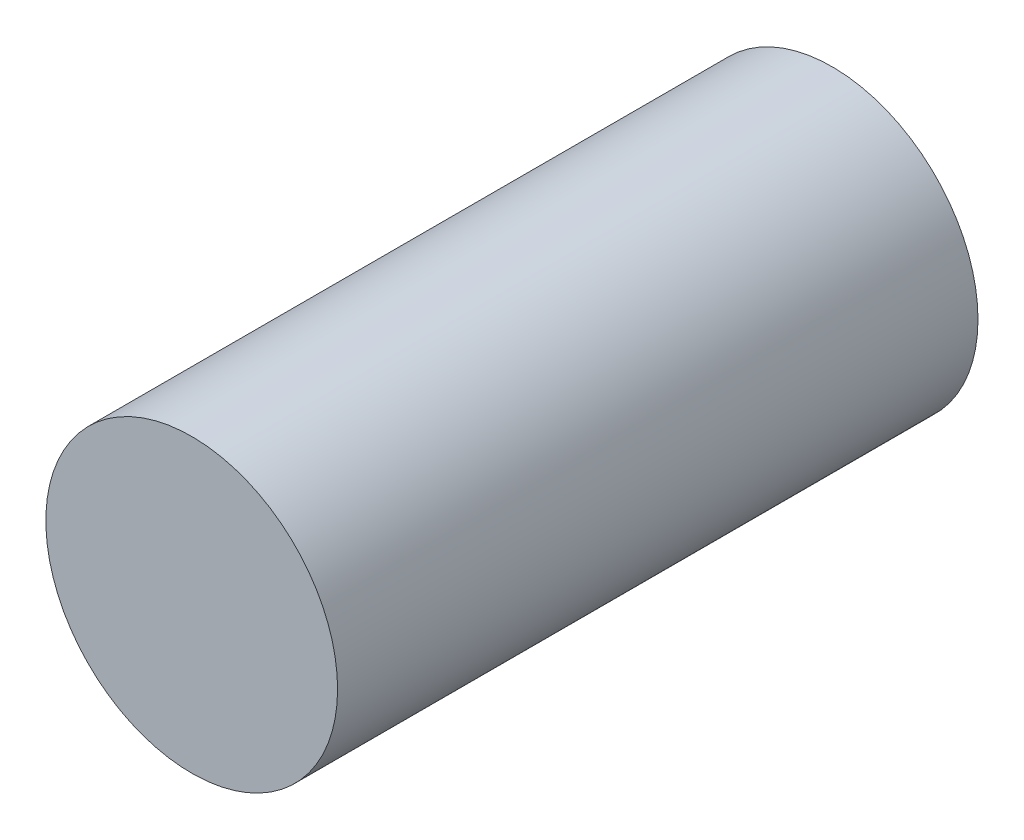
ISO-10303-21;
HEADER;
FILE_DESCRIPTION(('STEP AP214'),'2;1');
FILE_NAME('part.step','',(''),(''),'','','');
FILE_SCHEMA(('AUTOMOTIVE_DESIGN { 1 0 10303 214 1 1 1 1 }'));
ENDSEC;
DATA;
#1=APPLICATION_CONTEXT('core data for automotive mechanical design processes');
#2=APPLICATION_PROTOCOL_DEFINITION('international standard','automotive_design',2000,#1);
#3=PRODUCT_CONTEXT('',#1,'mechanical');
#4=PRODUCT('Part','Part','',(#3));
#5=PRODUCT_RELATED_PRODUCT_CATEGORY('part','',(#4));
#6=PRODUCT_DEFINITION_FORMATION('','',#4);
#7=PRODUCT_DEFINITION_CONTEXT('part definition',#1,'design');
#8=PRODUCT_DEFINITION('design','',#6,#7);
#9=PRODUCT_DEFINITION_SHAPE('','',#8);
#10=(LENGTH_UNIT() NAMED_UNIT(*) SI_UNIT(.MILLI.,.METRE.));
#11=(NAMED_UNIT(*) PLANE_ANGLE_UNIT() SI_UNIT($,.RADIAN.));
#12=(NAMED_UNIT(*) SI_UNIT($,.STERADIAN.) SOLID_ANGLE_UNIT());
#13=UNCERTAINTY_MEASURE_WITH_UNIT(LENGTH_MEASURE(1.E-05),#10,'distance_accuracy_value','');
#14=(GEOMETRIC_REPRESENTATION_CONTEXT(3) GLOBAL_UNCERTAINTY_ASSIGNED_CONTEXT((#13)) GLOBAL_UNIT_ASSIGNED_CONTEXT((#10,
#11,#12)) REPRESENTATION_CONTEXT('',''));
#15=CARTESIAN_POINT('',(0.,0.,0.));
#16=DIRECTION('',(0.,0.,1.));
#17=DIRECTION('',(1.,0.,0.));
#18=AXIS2_PLACEMENT_3D('',#15,#16,#17);
#19=CARTESIAN_POINT('',(-10.16,-1.27,0.1));
#20=DIRECTION('',(0.,0.,1.));
#21=DIRECTION('',(1.,0.,0.));
#22=AXIS2_PLACEMENT_3D('',#19,#20,#21);
#23=PLANE('',#22);
#24=CARTESIAN_POINT('',(-10.16,-1.27,0.1));
#25=DIRECTION('',(0.,0.,1.));
#26=DIRECTION('',(1.,0.,0.));
#27=AXIS2_PLACEMENT_3D('',#24,#25,#26);
#28=CIRCLE('',#27,0.41);
#29=CARTESIAN_POINT('',(-9.75,-1.27,0.1));
#30=VERTEX_POINT('',#29);
#31=EDGE_CURVE('E17',#30,#30,#28,.F.);
#32=ORIENTED_EDGE('',*,*,#31,.F.);
#33=EDGE_LOOP('',(#32));
#34=FACE_BOUND('',#33,.T.);
#35=ADVANCED_FACE('F14',(#34),#23,.T.);
#36=CARTESIAN_POINT('',(-10.16,-1.27,-1.7));
#37=DIRECTION('',(0.,0.,1.));
#38=DIRECTION('',(1.,0.,0.));
#39=AXIS2_PLACEMENT_3D('',#36,#37,#38);
#40=PLANE('',#39);
#41=CARTESIAN_POINT('',(-10.16,-1.27,-1.7));
#42=DIRECTION('',(0.,0.,1.));
#43=DIRECTION('',(1.,0.,0.));
#44=AXIS2_PLACEMENT_3D('',#41,#42,#43);
#45=CIRCLE('',#44,0.41);
#46=CARTESIAN_POINT('',(-9.75,-1.27,-1.7));
#47=VERTEX_POINT('',#46);
#48=EDGE_CURVE('E10',#47,#47,#45,.T.);
#49=ORIENTED_EDGE('',*,*,#48,.F.);
#50=EDGE_LOOP('',(#49));
#51=FACE_BOUND('',#50,.T.);
#52=ADVANCED_FACE('F29',(#51),#40,.F.);
#53=CARTESIAN_POINT('',(-10.16,-1.27,-1.7));
#54=DIRECTION('',(0.,0.,1.));
#55=DIRECTION('',(1.,0.,0.));
#56=AXIS2_PLACEMENT_3D('',#53,#54,#55);
#57=CYLINDRICAL_SURFACE('',#56,0.41);
#58=ORIENTED_EDGE('',*,*,#48,.T.);
#59=EDGE_LOOP('',(#58));
#60=FACE_BOUND('',#59,.T.);
#61=ORIENTED_EDGE('',*,*,#31,.T.);
#62=EDGE_LOOP('',(#61));
#63=FACE_BOUND('',#62,.T.);
#64=ADVANCED_FACE('F26',(#60,#63),#57,.T.);
#65=CLOSED_SHELL('',(#35,#52,#64));
#66=MANIFOLD_SOLID_BREP('B1',#65);
#67=ADVANCED_BREP_SHAPE_REPRESENTATION('',(#18,#66),#14);
#68=SHAPE_DEFINITION_REPRESENTATION(#9,#67);
ENDSEC;
END-ISO-10303-21;
